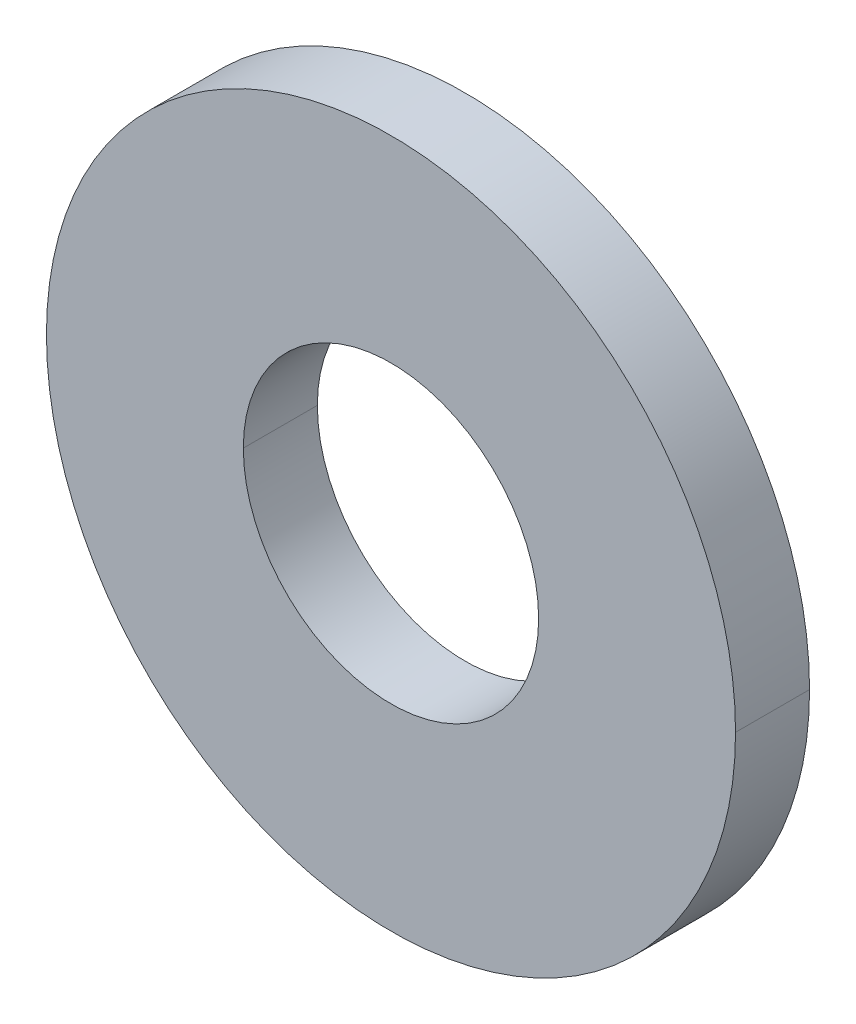
ISO-10303-21;
HEADER;
FILE_DESCRIPTION(('STEP AP214'),'2;1');
FILE_NAME('part.step','',(''),(''),'','','');
FILE_SCHEMA(('AUTOMOTIVE_DESIGN { 1 0 10303 214 1 1 1 1 }'));
ENDSEC;
DATA;
#1=APPLICATION_CONTEXT('core data for automotive mechanical design processes');
#2=APPLICATION_PROTOCOL_DEFINITION('international standard','automotive_design',2000,#1);
#3=PRODUCT_CONTEXT('',#1,'mechanical');
#4=PRODUCT('Part','Part','',(#3));
#5=PRODUCT_RELATED_PRODUCT_CATEGORY('part','',(#4));
#6=PRODUCT_DEFINITION_FORMATION('','',#4);
#7=PRODUCT_DEFINITION_CONTEXT('part definition',#1,'design');
#8=PRODUCT_DEFINITION('design','',#6,#7);
#9=PRODUCT_DEFINITION_SHAPE('','',#8);
#10=(LENGTH_UNIT() NAMED_UNIT(*) SI_UNIT(.MILLI.,.METRE.));
#11=(NAMED_UNIT(*) PLANE_ANGLE_UNIT() SI_UNIT($,.RADIAN.));
#12=(NAMED_UNIT(*) SI_UNIT($,.STERADIAN.) SOLID_ANGLE_UNIT());
#13=UNCERTAINTY_MEASURE_WITH_UNIT(LENGTH_MEASURE(1.E-05),#10,'distance_accuracy_value','');
#14=(GEOMETRIC_REPRESENTATION_CONTEXT(3) GLOBAL_UNCERTAINTY_ASSIGNED_CONTEXT((#13)) GLOBAL_UNIT_ASSIGNED_CONTEXT((#10,
#11,#12)) REPRESENTATION_CONTEXT('',''));
#15=CARTESIAN_POINT('',(0.,0.,0.));
#16=DIRECTION('',(0.,0.,1.));
#17=DIRECTION('',(1.,0.,0.));
#18=AXIS2_PLACEMENT_3D('',#15,#16,#17);
#19=CARTESIAN_POINT('',(0.,0.,0.));
#20=DIRECTION('',(0.,0.,1.));
#21=DIRECTION('',(1.,0.,0.));
#22=AXIS2_PLACEMENT_3D('',#19,#20,#21);
#23=CYLINDRICAL_SURFACE('',#22,2.38125);
#24=DIRECTION('',(0.,0.,1.));
#25=VECTOR('',#24,1.);
#26=CARTESIAN_POINT('',(2.38125,0.,0.));
#27=LINE('',#26,#25);
#28=CARTESIAN_POINT('',(2.38125,0.,0.));
#29=VERTEX_POINT('',#28);
#30=CARTESIAN_POINT('',(2.38125,0.,1.1938));
#31=VERTEX_POINT('',#30);
#32=EDGE_CURVE('E24',#29,#31,#27,.T.);
#33=ORIENTED_EDGE('',*,*,#32,.T.);
#34=CARTESIAN_POINT('',(0.,0.,1.1938));
#35=DIRECTION('',(0.,0.,-1.));
#36=DIRECTION('',(-1.,0.,0.));
#37=AXIS2_PLACEMENT_3D('',#34,#35,#36);
#38=CIRCLE('',#37,2.38125);
#39=CARTESIAN_POINT('',(-2.38125,0.,1.1938));
#40=VERTEX_POINT('',#39);
#41=EDGE_CURVE('E31',#40,#31,#38,.T.);
#42=ORIENTED_EDGE('',*,*,#41,.F.);
#43=DIRECTION('',(0.,0.,1.));
#44=VECTOR('',#43,1.);
#45=CARTESIAN_POINT('',(-2.38125,0.,0.));
#46=LINE('',#45,#44);
#47=CARTESIAN_POINT('',(-2.38125,0.,0.));
#48=VERTEX_POINT('',#47);
#49=EDGE_CURVE('E11',#48,#40,#46,.T.);
#50=ORIENTED_EDGE('',*,*,#49,.F.);
#51=CARTESIAN_POINT('',(0.,0.,0.));
#52=DIRECTION('',(0.,0.,-1.));
#53=DIRECTION('',(-1.,0.,0.));
#54=AXIS2_PLACEMENT_3D('',#51,#52,#53);
#55=CIRCLE('',#54,2.38125);
#56=EDGE_CURVE('E71',#48,#29,#55,.T.);
#57=ORIENTED_EDGE('',*,*,#56,.T.);
#58=EDGE_LOOP('',(#33,#42,#50,#57));
#59=FACE_BOUND('',#58,.T.);
#60=ADVANCED_FACE('F17',(#59),#23,.F.);
#61=CARTESIAN_POINT('',(0.,0.,0.));
#62=DIRECTION('',(0.,0.,1.));
#63=DIRECTION('',(1.,0.,0.));
#64=AXIS2_PLACEMENT_3D('',#61,#62,#63);
#65=CYLINDRICAL_SURFACE('',#64,2.38125);
#66=ORIENTED_EDGE('',*,*,#49,.T.);
#67=CARTESIAN_POINT('',(0.,0.,1.1938));
#68=DIRECTION('',(0.,0.,-1.));
#69=DIRECTION('',(1.,0.,0.));
#70=AXIS2_PLACEMENT_3D('',#67,#68,#69);
#71=CIRCLE('',#70,2.38125);
#72=EDGE_CURVE('E83',#31,#40,#71,.T.);
#73=ORIENTED_EDGE('',*,*,#72,.F.);
#74=ORIENTED_EDGE('',*,*,#32,.F.);
#75=CARTESIAN_POINT('',(0.,0.,0.));
#76=DIRECTION('',(0.,0.,-1.));
#77=DIRECTION('',(1.,0.,0.));
#78=AXIS2_PLACEMENT_3D('',#75,#76,#77);
#79=CIRCLE('',#78,2.38125);
#80=EDGE_CURVE('E65',#29,#48,#79,.T.);
#81=ORIENTED_EDGE('',*,*,#80,.T.);
#82=EDGE_LOOP('',(#66,#73,#74,#81));
#83=FACE_BOUND('',#82,.T.);
#84=ADVANCED_FACE('F90',(#83),#65,.F.);
#85=CARTESIAN_POINT('',(0.,0.,1.1938));
#86=DIRECTION('',(0.,0.,1.));
#87=DIRECTION('',(1.,0.,0.));
#88=AXIS2_PLACEMENT_3D('',#85,#86,#87);
#89=PLANE('',#88);
#90=ORIENTED_EDGE('',*,*,#41,.T.);
#91=ORIENTED_EDGE('',*,*,#72,.T.);
#92=EDGE_LOOP('',(#90,#91));
#93=FACE_BOUND('',#92,.T.);
#94=CARTESIAN_POINT('',(0.,0.,1.1938));
#95=DIRECTION('',(0.,0.,1.));
#96=DIRECTION('',(-1.,0.,0.));
#97=AXIS2_PLACEMENT_3D('',#94,#95,#96);
#98=CIRCLE('',#97,5.55625);
#99=CARTESIAN_POINT('',(-5.55625,0.,1.1938));
#100=VERTEX_POINT('',#99);
#101=CARTESIAN_POINT('',(5.55625,0.,1.1938));
#102=VERTEX_POINT('',#101);
#103=EDGE_CURVE('E80',#100,#102,#98,.T.);
#104=ORIENTED_EDGE('',*,*,#103,.T.);
#105=CARTESIAN_POINT('',(0.,0.,1.1938));
#106=DIRECTION('',(0.,0.,1.));
#107=DIRECTION('',(1.,0.,0.));
#108=AXIS2_PLACEMENT_3D('',#105,#106,#107);
#109=CIRCLE('',#108,5.55625);
#110=EDGE_CURVE('E70',#102,#100,#109,.T.);
#111=ORIENTED_EDGE('',*,*,#110,.T.);
#112=EDGE_LOOP('',(#104,#111));
#113=FACE_BOUND('',#112,.T.);
#114=ADVANCED_FACE('F87',(#93,#113),#89,.T.);
#115=CARTESIAN_POINT('',(0.,0.,0.));
#116=DIRECTION('',(0.,0.,1.));
#117=DIRECTION('',(1.,0.,0.));
#118=AXIS2_PLACEMENT_3D('',#115,#116,#117);
#119=CYLINDRICAL_SURFACE('',#118,5.55625);
#120=DIRECTION('',(0.,0.,1.));
#121=VECTOR('',#120,1.);
#122=CARTESIAN_POINT('',(5.55625,0.,0.));
#123=LINE('',#122,#121);
#124=CARTESIAN_POINT('',(5.55625,0.,0.));
#125=VERTEX_POINT('',#124);
#126=EDGE_CURVE('E58',#125,#102,#123,.T.);
#127=ORIENTED_EDGE('',*,*,#126,.T.);
#128=ORIENTED_EDGE('',*,*,#103,.F.);
#129=DIRECTION('',(0.,0.,1.));
#130=VECTOR('',#129,1.);
#131=CARTESIAN_POINT('',(-5.55625,0.,0.));
#132=LINE('',#131,#130);
#133=CARTESIAN_POINT('',(-5.55625,0.,0.));
#134=VERTEX_POINT('',#133);
#135=EDGE_CURVE('E61',#134,#100,#132,.T.);
#136=ORIENTED_EDGE('',*,*,#135,.F.);
#137=CARTESIAN_POINT('',(0.,0.,0.));
#138=DIRECTION('',(0.,0.,1.));
#139=DIRECTION('',(-1.,0.,0.));
#140=AXIS2_PLACEMENT_3D('',#137,#138,#139);
#141=CIRCLE('',#140,5.55625);
#142=EDGE_CURVE('E54',#134,#125,#141,.T.);
#143=ORIENTED_EDGE('',*,*,#142,.T.);
#144=EDGE_LOOP('',(#127,#128,#136,#143));
#145=FACE_BOUND('',#144,.T.);
#146=ADVANCED_FACE('F56',(#145),#119,.T.);
#147=CARTESIAN_POINT('',(0.,0.,0.));
#148=DIRECTION('',(0.,0.,1.));
#149=DIRECTION('',(1.,0.,0.));
#150=AXIS2_PLACEMENT_3D('',#147,#148,#149);
#151=CYLINDRICAL_SURFACE('',#150,5.55625);
#152=ORIENTED_EDGE('',*,*,#135,.T.);
#153=ORIENTED_EDGE('',*,*,#110,.F.);
#154=ORIENTED_EDGE('',*,*,#126,.F.);
#155=CARTESIAN_POINT('',(0.,0.,0.));
#156=DIRECTION('',(0.,0.,1.));
#157=DIRECTION('',(1.,0.,0.));
#158=AXIS2_PLACEMENT_3D('',#155,#156,#157);
#159=CIRCLE('',#158,5.55625);
#160=EDGE_CURVE('E66',#125,#134,#159,.T.);
#161=ORIENTED_EDGE('',*,*,#160,.T.);
#162=EDGE_LOOP('',(#152,#153,#154,#161));
#163=FACE_BOUND('',#162,.T.);
#164=ADVANCED_FACE('F69',(#163),#151,.T.);
#165=CARTESIAN_POINT('',(0.,0.,0.));
#166=DIRECTION('',(0.,0.,1.));
#167=DIRECTION('',(1.,0.,0.));
#168=AXIS2_PLACEMENT_3D('',#165,#166,#167);
#169=PLANE('',#168);
#170=ORIENTED_EDGE('',*,*,#56,.F.);
#171=ORIENTED_EDGE('',*,*,#80,.F.);
#172=EDGE_LOOP('',(#170,#171));
#173=FACE_BOUND('',#172,.T.);
#174=ORIENTED_EDGE('',*,*,#142,.F.);
#175=ORIENTED_EDGE('',*,*,#160,.F.);
#176=EDGE_LOOP('',(#174,#175));
#177=FACE_BOUND('',#176,.T.);
#178=ADVANCED_FACE('F73',(#173,#177),#169,.F.);
#179=CLOSED_SHELL('',(#60,#84,#114,#146,#164,#178));
#180=MANIFOLD_SOLID_BREP('B1',#179);
#181=ADVANCED_BREP_SHAPE_REPRESENTATION('',(#18,#180),#14);
#182=SHAPE_DEFINITION_REPRESENTATION(#9,#181);
ENDSEC;
END-ISO-10303-21;
